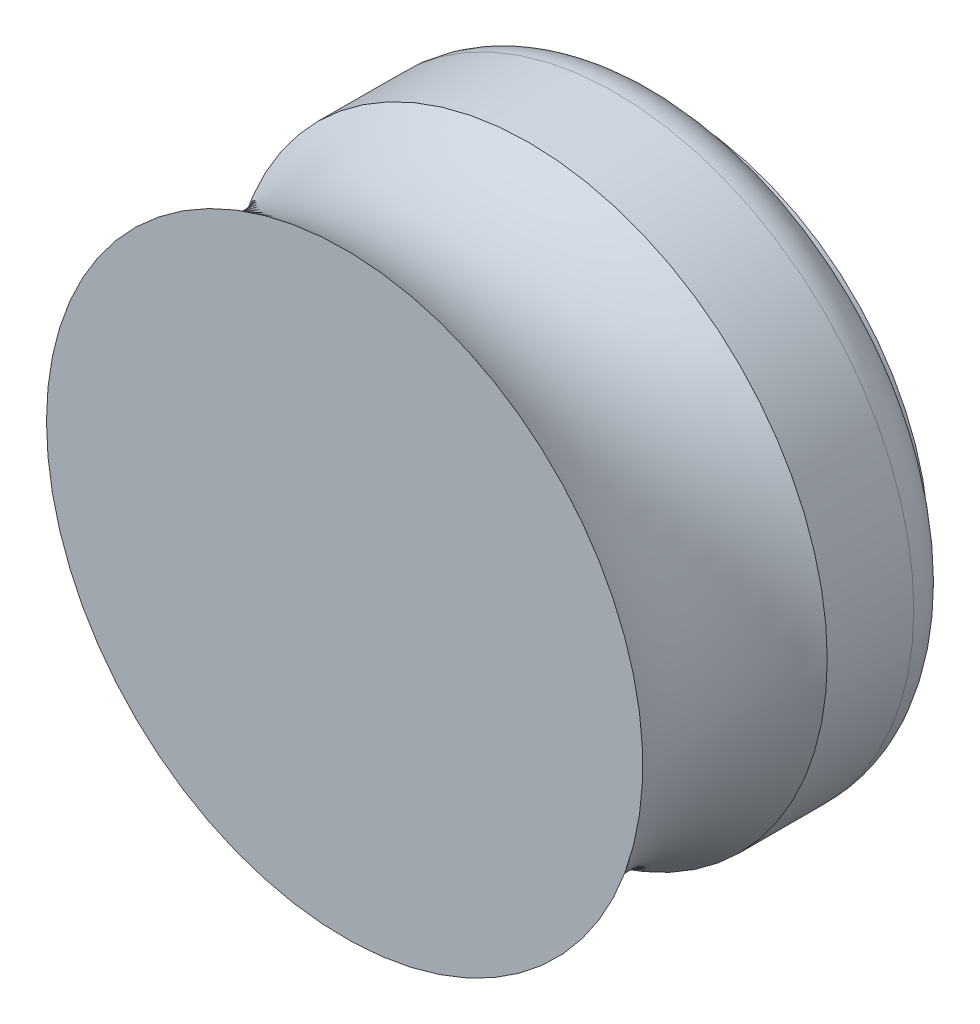
ISO-10303-21;
HEADER;
FILE_DESCRIPTION(('STEP AP214'),'2;1');
FILE_NAME('part.step','',(''),(''),'','','');
FILE_SCHEMA(('AUTOMOTIVE_DESIGN { 1 0 10303 214 1 1 1 1 }'));
ENDSEC;
DATA;
#1=APPLICATION_CONTEXT('core data for automotive mechanical design processes');
#2=APPLICATION_PROTOCOL_DEFINITION('international standard','automotive_design',2000,#1);
#3=PRODUCT_CONTEXT('',#1,'mechanical');
#4=PRODUCT('Part','Part','',(#3));
#5=PRODUCT_RELATED_PRODUCT_CATEGORY('part','',(#4));
#6=PRODUCT_DEFINITION_FORMATION('','',#4);
#7=PRODUCT_DEFINITION_CONTEXT('part definition',#1,'design');
#8=PRODUCT_DEFINITION('design','',#6,#7);
#9=PRODUCT_DEFINITION_SHAPE('','',#8);
#10=(LENGTH_UNIT() NAMED_UNIT(*) SI_UNIT(.MILLI.,.METRE.));
#11=(NAMED_UNIT(*) PLANE_ANGLE_UNIT() SI_UNIT($,.RADIAN.));
#12=(NAMED_UNIT(*) SI_UNIT($,.STERADIAN.) SOLID_ANGLE_UNIT());
#13=UNCERTAINTY_MEASURE_WITH_UNIT(LENGTH_MEASURE(1.E-05),#10,'distance_accuracy_value','');
#14=(GEOMETRIC_REPRESENTATION_CONTEXT(3) GLOBAL_UNCERTAINTY_ASSIGNED_CONTEXT((#13)) GLOBAL_UNIT_ASSIGNED_CONTEXT((#10,
#11,#12)) REPRESENTATION_CONTEXT('',''));
#15=CARTESIAN_POINT('',(0.,0.,0.));
#16=DIRECTION('',(0.,0.,1.));
#17=DIRECTION('',(1.,0.,0.));
#18=AXIS2_PLACEMENT_3D('',#15,#16,#17);
#19=CARTESIAN_POINT('',(-109.435261655171,-75.8999546142996,0.00468216636028274));
#20=DIRECTION('',(0.,0.,-1.));
#21=DIRECTION('',(-1.,0.,0.));
#22=AXIS2_PLACEMENT_3D('',#19,#20,#21);
#23=PLANE('',#22);
#24=CARTESIAN_POINT('',(-110.435261655171,-75.8999546142996,0.00468216636028262));
#25=DIRECTION('',(0.,0.,1.));
#26=DIRECTION('',(1.,0.,0.));
#27=AXIS2_PLACEMENT_3D('',#24,#25,#26);
#28=CIRCLE('',#27,2.);
#29=CARTESIAN_POINT('',(-108.435261655171,-75.8999546142996,0.00468216636028274));
#30=VERTEX_POINT('',#29);
#31=EDGE_CURVE('E23',#30,#30,#28,.T.);
#32=ORIENTED_EDGE('',*,*,#31,.F.);
#33=EDGE_LOOP('',(#32));
#34=FACE_BOUND('',#33,.T.);
#35=ADVANCED_FACE('F19',(#34),#23,.T.);
#36=CARTESIAN_POINT('',(-110.435261655171,-75.8999546142996,0.00468216636029695));
#37=DIRECTION('',(0.,0.,1.));
#38=DIRECTION('',(1.,0.,0.));
#39=AXIS2_PLACEMENT_3D('',#36,#37,#38);
#40=CYLINDRICAL_SURFACE('',#39,2.);
#41=CARTESIAN_POINT('',(-110.435261655171,-75.8999546142996,0.124682166360297));
#42=DIRECTION('',(0.,0.,1.));
#43=DIRECTION('',(1.,0.,0.));
#44=AXIS2_PLACEMENT_3D('',#41,#42,#43);
#45=CIRCLE('',#44,2.00000000000001);
#46=CARTESIAN_POINT('',(-108.435261655171,-75.8999546142996,0.124682166360297));
#47=VERTEX_POINT('',#46);
#48=EDGE_CURVE('E34',#47,#47,#45,.T.);
#49=ORIENTED_EDGE('',*,*,#48,.F.);
#50=EDGE_LOOP('',(#49));
#51=FACE_BOUND('',#50,.T.);
#52=ORIENTED_EDGE('',*,*,#31,.T.);
#53=EDGE_LOOP('',(#52));
#54=FACE_BOUND('',#53,.T.);
#55=ADVANCED_FACE('F45',(#51,#54),#40,.T.);
#56=CARTESIAN_POINT('',(-110.435261655171,-75.8999546142996,0.504682166360297));
#57=DIRECTION('',(0.,0.,-1.));
#58=DIRECTION('',(-1.,0.,0.));
#59=AXIS2_PLACEMENT_3D('',#56,#57,#58);
#60=TOROIDAL_SURFACE('',#59,2.,0.380000000000003);
#61=ORIENTED_EDGE('',*,*,#48,.T.);
#62=EDGE_LOOP('',(#61));
#63=FACE_BOUND('',#62,.T.);
#64=CARTESIAN_POINT('',(-110.435261655171,-75.8999546142996,0.504682166360297));
#65=DIRECTION('',(0.,0.,1.));
#66=DIRECTION('',(1.,0.,0.));
#67=AXIS2_PLACEMENT_3D('',#64,#65,#66);
#68=CIRCLE('',#67,2.37999999999999);
#69=CARTESIAN_POINT('',(-108.055261655171,-75.8999546142996,0.504682166360297));
#70=VERTEX_POINT('',#69);
#71=EDGE_CURVE('E31',#70,#70,#68,.T.);
#72=ORIENTED_EDGE('',*,*,#71,.F.);
#73=EDGE_LOOP('',(#72));
#74=FACE_BOUND('',#73,.T.);
#75=ADVANCED_FACE('F43',(#63,#74),#60,.T.);
#76=CARTESIAN_POINT('',(-110.435261655171,-75.8999546142996,0.868463591020813));
#77=DIRECTION('',(0.,0.,1.));
#78=DIRECTION('',(1.,0.,0.));
#79=AXIS2_PLACEMENT_3D('',#76,#77,#78);
#80=CYLINDRICAL_SURFACE('',#79,2.37999999999999);
#81=ORIENTED_EDGE('',*,*,#71,.T.);
#82=EDGE_LOOP('',(#81));
#83=FACE_BOUND('',#82,.T.);
#84=CARTESIAN_POINT('',(-110.435261655171,-75.8999546142996,1.19437104261421));
#85=DIRECTION('',(0.,0.,-1.));
#86=DIRECTION('',(-1.,0.,0.));
#87=AXIS2_PLACEMENT_3D('',#84,#85,#86);
#88=CIRCLE('',#87,2.38);
#89=CARTESIAN_POINT('',(-112.815261655171,-75.8999546142996,1.19437104261421));
#90=VERTEX_POINT('',#89);
#91=EDGE_CURVE('E27',#90,#90,#88,.T.);
#92=ORIENTED_EDGE('',*,*,#91,.T.);
#93=EDGE_LOOP('',(#92));
#94=FACE_BOUND('',#93,.T.);
#95=ADVANCED_FACE('F40',(#83,#94),#80,.T.);
#96=CARTESIAN_POINT('',(-110.435261655171,-75.8999546142996,1.93052713865621));
#97=DIRECTION('',(0.,0.,-1.));
#98=DIRECTION('',(-1.,0.,0.));
#99=AXIS2_PLACEMENT_3D('',#96,#97,#98);
#100=TOROIDAL_SURFACE('',#99,3.46382852414194,1.31019466778166);
#101=ORIENTED_EDGE('',*,*,#91,.F.);
#102=EDGE_LOOP('',(#101));
#103=FACE_BOUND('',#102,.T.);
#104=CARTESIAN_POINT('',(-110.435261655171,-75.8999546142996,2.66200106833793));
#105=DIRECTION('',(0.,0.,-1.));
#106=DIRECTION('',(-1.,0.,0.));
#107=AXIS2_PLACEMENT_3D('',#104,#105,#106);
#108=CIRCLE('',#107,2.37683452338598);
#109=CARTESIAN_POINT('',(-112.812096178557,-75.8999546142996,2.66200106833793));
#110=VERTEX_POINT('',#109);
#111=EDGE_CURVE('E11',#110,#110,#108,.F.);
#112=ORIENTED_EDGE('',*,*,#111,.F.);
#113=EDGE_LOOP('',(#112));
#114=FACE_BOUND('',#113,.T.);
#115=ADVANCED_FACE('F21',(#103,#114),#100,.F.);
#116=CARTESIAN_POINT('',(-110.435261655171,-75.8999546142996,2.66200106833793));
#117=DIRECTION('',(0.,0.,1.));
#118=DIRECTION('',(1.,0.,0.));
#119=AXIS2_PLACEMENT_3D('',#116,#117,#118);
#120=PLANE('',#119);
#121=ORIENTED_EDGE('',*,*,#111,.T.);
#122=EDGE_LOOP('',(#121));
#123=FACE_BOUND('',#122,.T.);
#124=ADVANCED_FACE('F56',(#123),#120,.T.);
#125=CLOSED_SHELL('',(#35,#55,#75,#95,#115,#124));
#126=MANIFOLD_SOLID_BREP('B1',#125);
#127=ADVANCED_BREP_SHAPE_REPRESENTATION('',(#18,#126),#14);
#128=SHAPE_DEFINITION_REPRESENTATION(#9,#127);
ENDSEC;
END-ISO-10303-21;
